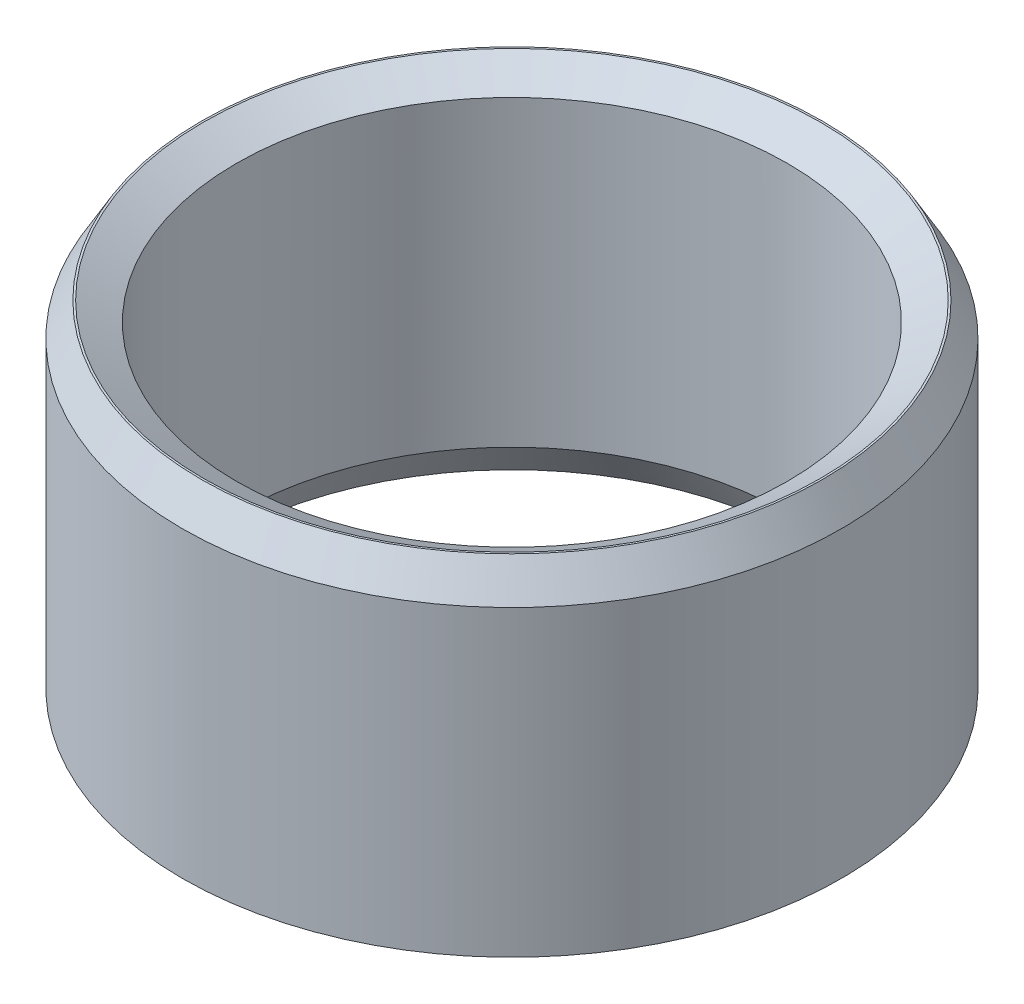
ISO-10303-21;
HEADER;
FILE_DESCRIPTION(('STEP AP214'),'2;1');
FILE_NAME('part.step','',(''),(''),'','','');
FILE_SCHEMA(('AUTOMOTIVE_DESIGN { 1 0 10303 214 1 1 1 1 }'));
ENDSEC;
DATA;
#1=APPLICATION_CONTEXT('core data for automotive mechanical design processes');
#2=APPLICATION_PROTOCOL_DEFINITION('international standard','automotive_design',2000,#1);
#3=PRODUCT_CONTEXT('',#1,'mechanical');
#4=PRODUCT('Part','Part','',(#3));
#5=PRODUCT_RELATED_PRODUCT_CATEGORY('part','',(#4));
#6=PRODUCT_DEFINITION_FORMATION('','',#4);
#7=PRODUCT_DEFINITION_CONTEXT('part definition',#1,'design');
#8=PRODUCT_DEFINITION('design','',#6,#7);
#9=PRODUCT_DEFINITION_SHAPE('','',#8);
#10=(LENGTH_UNIT() NAMED_UNIT(*) SI_UNIT(.MILLI.,.METRE.));
#11=(NAMED_UNIT(*) PLANE_ANGLE_UNIT() SI_UNIT($,.RADIAN.));
#12=(NAMED_UNIT(*) SI_UNIT($,.STERADIAN.) SOLID_ANGLE_UNIT());
#13=UNCERTAINTY_MEASURE_WITH_UNIT(LENGTH_MEASURE(1.E-05),#10,'distance_accuracy_value','');
#14=(GEOMETRIC_REPRESENTATION_CONTEXT(3) GLOBAL_UNCERTAINTY_ASSIGNED_CONTEXT((#13)) GLOBAL_UNIT_ASSIGNED_CONTEXT((#10,
#11,#12)) REPRESENTATION_CONTEXT('',''));
#15=CARTESIAN_POINT('',(0.,0.,0.));
#16=DIRECTION('',(0.,0.,1.));
#17=DIRECTION('',(1.,0.,0.));
#18=AXIS2_PLACEMENT_3D('',#15,#16,#17);
#19=CARTESIAN_POINT('',(0.,37.7037721472574,0.));
#20=DIRECTION('',(0.,-1.,0.));
#21=DIRECTION('',(0.,0.,-1.));
#22=AXIS2_PLACEMENT_3D('',#19,#20,#21);
#23=CYLINDRICAL_SURFACE('',#22,35.);
#24=CARTESIAN_POINT('',(0.,2.02689998190421,0.));
#25=DIRECTION('',(0.,1.,0.));
#26=DIRECTION('',(0.,0.,1.));
#27=AXIS2_PLACEMENT_3D('',#24,#25,#26);
#28=CIRCLE('',#27,35.);
#29=CARTESIAN_POINT('',(0.,2.02689998190421,35.));
#30=VERTEX_POINT('',#29);
#31=EDGE_CURVE('E10',#30,#30,#28,.T.);
#32=ORIENTED_EDGE('',*,*,#31,.T.);
#33=EDGE_LOOP('',(#32));
#34=FACE_BOUND('',#33,.T.);
#35=CARTESIAN_POINT('',(0.,34.1930783967388,0.));
#36=DIRECTION('',(0.,1.,0.));
#37=DIRECTION('',(0.,0.,1.));
#38=AXIS2_PLACEMENT_3D('',#35,#36,#37);
#39=CIRCLE('',#38,35.);
#40=CARTESIAN_POINT('',(0.,34.1930783967388,35.));
#41=VERTEX_POINT('',#40);
#42=EDGE_CURVE('E50',#41,#41,#39,.F.);
#43=ORIENTED_EDGE('',*,*,#42,.T.);
#44=EDGE_LOOP('',(#43));
#45=FACE_BOUND('',#44,.T.);
#46=ADVANCED_FACE('F39',(#34,#45),#23,.T.);
#47=CARTESIAN_POINT('',(0.,37.7037721472574,0.));
#48=DIRECTION('',(0.,1.,0.));
#49=DIRECTION('',(0.,0.,1.));
#50=AXIS2_PLACEMENT_3D('',#47,#48,#49);
#51=PLANE('',#50);
#52=CARTESIAN_POINT('',(0.,37.7037721472574,0.));
#53=DIRECTION('',(0.,1.,0.));
#54=DIRECTION('',(0.,0.,1.));
#55=AXIS2_PLACEMENT_3D('',#52,#53,#54);
#56=CIRCLE('',#55,32.765087513426);
#57=CARTESIAN_POINT('',(0.,37.7037721472574,32.765087513426));
#58=VERTEX_POINT('',#57);
#59=EDGE_CURVE('E58',#58,#58,#56,.F.);
#60=ORIENTED_EDGE('',*,*,#59,.T.);
#61=EDGE_LOOP('',(#60));
#62=FACE_BOUND('',#61,.T.);
#63=CARTESIAN_POINT('',(0.,37.7037721472574,0.));
#64=DIRECTION('',(0.,1.,0.));
#65=DIRECTION('',(0.,0.,1.));
#66=AXIS2_PLACEMENT_3D('',#63,#64,#65);
#67=CIRCLE('',#66,32.9731000180958);
#68=CARTESIAN_POINT('',(0.,37.7037721472574,32.9731000180958));
#69=VERTEX_POINT('',#68);
#70=EDGE_CURVE('E61',#69,#69,#67,.T.);
#71=ORIENTED_EDGE('',*,*,#70,.T.);
#72=EDGE_LOOP('',(#71));
#73=FACE_BOUND('',#72,.T.);
#74=ADVANCED_FACE('F88',(#62,#73),#51,.T.);
#75=CARTESIAN_POINT('',(0.,0.,0.));
#76=DIRECTION('',(0.,1.,0.));
#77=DIRECTION('',(0.,0.,1.));
#78=AXIS2_PLACEMENT_3D('',#75,#76,#77);
#79=PLANE('',#78);
#80=CARTESIAN_POINT('',(0.,0.,0.));
#81=DIRECTION('',(0.,1.,0.));
#82=DIRECTION('',(0.,0.,1.));
#83=AXIS2_PLACEMENT_3D('',#80,#81,#82);
#84=CIRCLE('',#83,31.2812937448117);
#85=CARTESIAN_POINT('',(0.,0.,-31.2812937448117));
#86=VERTEX_POINT('',#85);
#87=EDGE_CURVE('E51',#86,#86,#84,.T.);
#88=ORIENTED_EDGE('',*,*,#87,.T.);
#89=EDGE_LOOP('',(#88));
#90=FACE_BOUND('',#89,.T.);
#91=CARTESIAN_POINT('',(0.,0.,0.));
#92=DIRECTION('',(0.,1.,0.));
#93=DIRECTION('',(0.,0.,1.));
#94=AXIS2_PLACEMENT_3D('',#91,#92,#93);
#95=CIRCLE('',#94,31.4893062494815);
#96=CARTESIAN_POINT('',(0.,0.,31.4893062494815));
#97=VERTEX_POINT('',#96);
#98=EDGE_CURVE('E54',#97,#97,#95,.F.);
#99=ORIENTED_EDGE('',*,*,#98,.T.);
#100=EDGE_LOOP('',(#99));
#101=FACE_BOUND('',#100,.T.);
#102=ADVANCED_FACE('F83',(#90,#101),#79,.F.);
#103=CARTESIAN_POINT('',(0.,37.7037721472574,0.));
#104=DIRECTION('',(0.,-1.,0.));
#105=DIRECTION('',(0.,0.,-1.));
#106=AXIS2_PLACEMENT_3D('',#103,#104,#105);
#107=CYLINDRICAL_SURFACE('',#106,29.2543937629074);
#108=CARTESIAN_POINT('',(0.,35.6768721653531,0.));
#109=DIRECTION('',(0.,1.,0.));
#110=DIRECTION('',(0.,0.,1.));
#111=AXIS2_PLACEMENT_3D('',#108,#109,#110);
#112=CIRCLE('',#111,29.2543937629074);
#113=CARTESIAN_POINT('',(0.,35.6768721653531,29.2543937629074));
#114=VERTEX_POINT('',#113);
#115=EDGE_CURVE('E67',#114,#114,#112,.T.);
#116=ORIENTED_EDGE('',*,*,#115,.T.);
#117=EDGE_LOOP('',(#116));
#118=FACE_BOUND('',#117,.T.);
#119=CARTESIAN_POINT('',(0.,3.51069375051857,0.));
#120=DIRECTION('',(0.,1.,0.));
#121=DIRECTION('',(0.,0.,1.));
#122=AXIS2_PLACEMENT_3D('',#119,#120,#121);
#123=CIRCLE('',#122,29.2543937629074);
#124=CARTESIAN_POINT('',(0.,3.51069375051857,-29.2543937629074));
#125=VERTEX_POINT('',#124);
#126=EDGE_CURVE('E69',#125,#125,#123,.F.);
#127=ORIENTED_EDGE('',*,*,#126,.T.);
#128=EDGE_LOOP('',(#127));
#129=FACE_BOUND('',#128,.T.);
#130=ADVANCED_FACE('F71',(#118,#129),#107,.F.);
#131=CARTESIAN_POINT('',(0.,35.6768721653531,0.));
#132=DIRECTION('',(0.,1.,0.));
#133=DIRECTION('',(0.,0.,1.));
#134=AXIS2_PLACEMENT_3D('',#131,#132,#133);
#135=CONICAL_SURFACE('',#134,29.2543937629074,1.0471975511966);
#136=ORIENTED_EDGE('',*,*,#59,.F.);
#137=EDGE_LOOP('',(#136));
#138=FACE_BOUND('',#137,.T.);
#139=ORIENTED_EDGE('',*,*,#115,.F.);
#140=EDGE_LOOP('',(#139));
#141=FACE_BOUND('',#140,.T.);
#142=ADVANCED_FACE('F77',(#138,#141),#135,.F.);
#143=CARTESIAN_POINT('',(0.,0.,0.));
#144=DIRECTION('',(0.,-1.,0.));
#145=DIRECTION('',(0.,0.,-1.));
#146=AXIS2_PLACEMENT_3D('',#143,#144,#145);
#147=CONICAL_SURFACE('',#146,31.2812937448117,0.523598775598296);
#148=CARTESIAN_POINT('',(0.,3.51069375051857,-29.2543937629074));
#149=CARTESIAN_POINT('',(0.,3.47412402395066,-29.2755073043856));
#150=CARTESIAN_POINT('',(0.,3.43755429738276,-29.2966208458638));
#151=CARTESIAN_POINT('',(0.,3.36441484424696,-29.3388479288201));
#152=CARTESIAN_POINT('',(0.,3.32784511767906,-29.3599614702983));
#153=CARTESIAN_POINT('',(0.,3.25470566454325,-29.4021885532546));
#154=CARTESIAN_POINT('',(0.,3.21813593797535,-29.4233020947328));
#155=CARTESIAN_POINT('',(0.,3.14499648483955,-29.4655291776891));
#156=CARTESIAN_POINT('',(0.,3.10842675827165,-29.4866427191673));
#157=CARTESIAN_POINT('',(0.,3.03528730513584,-29.5288698021236));
#158=CARTESIAN_POINT('',(0.,2.99871757856794,-29.5499833436018));
#159=CARTESIAN_POINT('',(0.,2.92557812543214,-29.5922104265581));
#160=CARTESIAN_POINT('',(0.,2.88900839886424,-29.6133239680363));
#161=CARTESIAN_POINT('',(0.,2.81586894572843,-29.6555510509926));
#162=CARTESIAN_POINT('',(0.,2.77929921916053,-29.6766645924708));
#163=CARTESIAN_POINT('',(0.,2.70615976602473,-29.7188916754272));
#164=CARTESIAN_POINT('',(0.,2.66959003945683,-29.7400052169053));
#165=CARTESIAN_POINT('',(0.,2.59645058632102,-29.7822322998617));
#166=CARTESIAN_POINT('',(0.,2.55988085975312,-29.8033458413398));
#167=CARTESIAN_POINT('',(0.,2.48674140661732,-29.8455729242962));
#168=CARTESIAN_POINT('',(0.,2.45017168004942,-29.8666864657743));
#169=CARTESIAN_POINT('',(0.,2.37703222691361,-29.9089135487307));
#170=CARTESIAN_POINT('',(0.,2.34046250034571,-29.9300270902088));
#171=CARTESIAN_POINT('',(0.,2.26732304720991,-29.9722541731652));
#172=CARTESIAN_POINT('',(0.,2.23075332064201,-29.9933677146434));
#173=CARTESIAN_POINT('',(0.,2.1576138675062,-30.0355947975997));
#174=CARTESIAN_POINT('',(0.,2.1210441409383,-30.0567083390779));
#175=CARTESIAN_POINT('',(0.,2.0479046878025,-30.0989354220342));
#176=CARTESIAN_POINT('',(0.,2.0113349612346,-30.1200489635124));
#177=CARTESIAN_POINT('',(0.,1.93819550809879,-30.1622760464687));
#178=CARTESIAN_POINT('',(0.,1.90162578153089,-30.1833895879469));
#179=CARTESIAN_POINT('',(0.,1.82848632839509,-30.2256166709032));
#180=CARTESIAN_POINT('',(0.,1.79191660182718,-30.2467302123814));
#181=CARTESIAN_POINT('',(0.,1.71877714869138,-30.2889572953377));
#182=CARTESIAN_POINT('',(0.,1.68220742212348,-30.3100708368159));
#183=CARTESIAN_POINT('',(0.,1.60906796898768,-30.3522979197722));
#184=CARTESIAN_POINT('',(0.,1.57249824241977,-30.3734114612504));
#185=CARTESIAN_POINT('',(0.,1.49935878928397,-30.4156385442067));
#186=CARTESIAN_POINT('',(0.,1.46278906271607,-30.4367520856849));
#187=CARTESIAN_POINT('',(0.,1.38964960958027,-30.4789791686412));
#188=CARTESIAN_POINT('',(0.,1.35307988301236,-30.5000927101194));
#189=CARTESIAN_POINT('',(0.,1.27994042987656,-30.5423197930757));
#190=CARTESIAN_POINT('',(0.,1.24337070330866,-30.5634333345539));
#191=CARTESIAN_POINT('',(0.,1.17023125017285,-30.6056604175103));
#192=CARTESIAN_POINT('',(0.,1.13366152360495,-30.6267739589884));
#193=CARTESIAN_POINT('',(0.,1.06052207046915,-30.6690010419448));
#194=CARTESIAN_POINT('',(0.,1.02395234390125,-30.6901145834229));
#195=CARTESIAN_POINT('',(0.,0.950812890765445,-30.7323416663793));
#196=CARTESIAN_POINT('',(0.,0.914243164197543,-30.7534552078574));
#197=CARTESIAN_POINT('',(0.,0.84110371106174,-30.7956822908138));
#198=CARTESIAN_POINT('',(0.,0.804533984493838,-30.8167958322919));
#199=CARTESIAN_POINT('',(0.,0.731394531358035,-30.8590229152483));
#200=CARTESIAN_POINT('',(0.,0.694824804790133,-30.8801364567265));
#201=CARTESIAN_POINT('',(0.,0.621685351654329,-30.9223635396828));
#202=CARTESIAN_POINT('',(0.,0.585115625086428,-30.943477081161));
#203=CARTESIAN_POINT('',(0.,0.511976171950624,-30.9857041641173));
#204=CARTESIAN_POINT('',(0.,0.475406445382723,-31.0068177055955));
#205=CARTESIAN_POINT('',(0.,0.402266992246919,-31.0490447885518));
#206=CARTESIAN_POINT('',(0.,0.365697265679017,-31.07015833003));
#207=CARTESIAN_POINT('',(0.,0.292557812543213,-31.1123854129863));
#208=CARTESIAN_POINT('',(0.,0.255988085975312,-31.1334989544645));
#209=CARTESIAN_POINT('',(0.,0.182848632839509,-31.1757260374208));
#210=CARTESIAN_POINT('',(0.,0.146278906271607,-31.196839578899));
#211=CARTESIAN_POINT('',(0.,0.0731394531358034,-31.2390666618553));
#212=CARTESIAN_POINT('',(0.,0.0365697265679015,-31.2601802033335));
#213=CARTESIAN_POINT('',(0.,0.,-31.2812937448117));
#214=B_SPLINE_CURVE_WITH_KNOTS('',3,(#148,#149,#150,#151,#152,#153,#154,#155,#156,#157,#158,
#159,#160,#161,#162,#163,#164,#165,#166,#167,#168,#169,#170,#171,#172,#173,#174,#175,#176,#177,
#178,#179,#180,#181,#182,#183,#184,#185,#186,#187,#188,#189,#190,#191,#192,#193,#194,#195,#196,
#197,#198,#199,#200,#201,#202,#203,#204,#205,#206,#207,#208,#209,#210,#211,#212,#213),
.UNSPECIFIED.,.F.,.F.,(4,2,2,2,2,2,2,2,2,2,2,2,2,2,2,2,2,2,2,2,2,2,2,2,2,2,2,2,2,2,2,2,4),(0.,
0.126681248869014,0.253362497738028,0.380043746607042,0.506724995476057,0.633406244345071,
0.760087493214085,0.886768742083099,1.01344999095211,1.14013123982113,1.26681248869014,
1.39349373755916,1.52017498642817,1.64685623529718,1.7735374841662,1.90021873303521,
2.02689998190423,2.15358123077324,2.28026247964226,2.40694372851127,2.53362497738028,
2.6603062262493,2.78698747511831,2.91366872398733,3.04034997285634,3.16703122172536,
3.29371247059437,3.42039371946338,3.5470749683324,3.67375621720141,3.80043746607043,
3.92711871493944,4.05379996380845),.UNSPECIFIED.);
#215=EDGE_CURVE('BSEAM73',#125,#86,#214,.T.);
#216=ORIENTED_EDGE('',*,*,#126,.F.);
#217=ORIENTED_EDGE('',*,*,#87,.F.);
#218=ORIENTED_EDGE('',*,*,#215,.T.);
#219=ORIENTED_EDGE('',*,*,#215,.F.);
#220=EDGE_LOOP('',(#216,#218,#217,#219));
#221=FACE_BOUND('',#220,.T.);
#222=ADVANCED_FACE('F73',(#221),#147,.F.);
#223=CARTESIAN_POINT('',(0.,2.02689998190421,0.));
#224=DIRECTION('',(0.,1.,0.));
#225=DIRECTION('',(0.,0.,1.));
#226=AXIS2_PLACEMENT_3D('',#223,#224,#225);
#227=CONICAL_SURFACE('',#226,35.,1.0471975511966);
#228=ORIENTED_EDGE('',*,*,#98,.F.);
#229=EDGE_LOOP('',(#228));
#230=FACE_BOUND('',#229,.T.);
#231=ORIENTED_EDGE('',*,*,#31,.F.);
#232=EDGE_LOOP('',(#231));
#233=FACE_BOUND('',#232,.T.);
#234=ADVANCED_FACE('F76',(#230,#233),#227,.T.);
#235=CARTESIAN_POINT('',(0.,37.7037721472574,0.));
#236=DIRECTION('',(0.,-1.,0.));
#237=DIRECTION('',(0.,0.,-1.));
#238=AXIS2_PLACEMENT_3D('',#235,#236,#237);
#239=CONICAL_SURFACE('',#238,32.9731000180958,0.523598775598296);
#240=ORIENTED_EDGE('',*,*,#42,.F.);
#241=EDGE_LOOP('',(#240));
#242=FACE_BOUND('',#241,.T.);
#243=ORIENTED_EDGE('',*,*,#70,.F.);
#244=EDGE_LOOP('',(#243));
#245=FACE_BOUND('',#244,.T.);
#246=ADVANCED_FACE('F45',(#242,#245),#239,.T.);
#247=CLOSED_SHELL('',(#46,#74,#102,#130,#142,#222,#234,#246));
#248=MANIFOLD_SOLID_BREP('B2',#247);
#249=ADVANCED_BREP_SHAPE_REPRESENTATION('',(#18,#248),#14);
#250=SHAPE_DEFINITION_REPRESENTATION(#9,#249);
ENDSEC;
END-ISO-10303-21;
